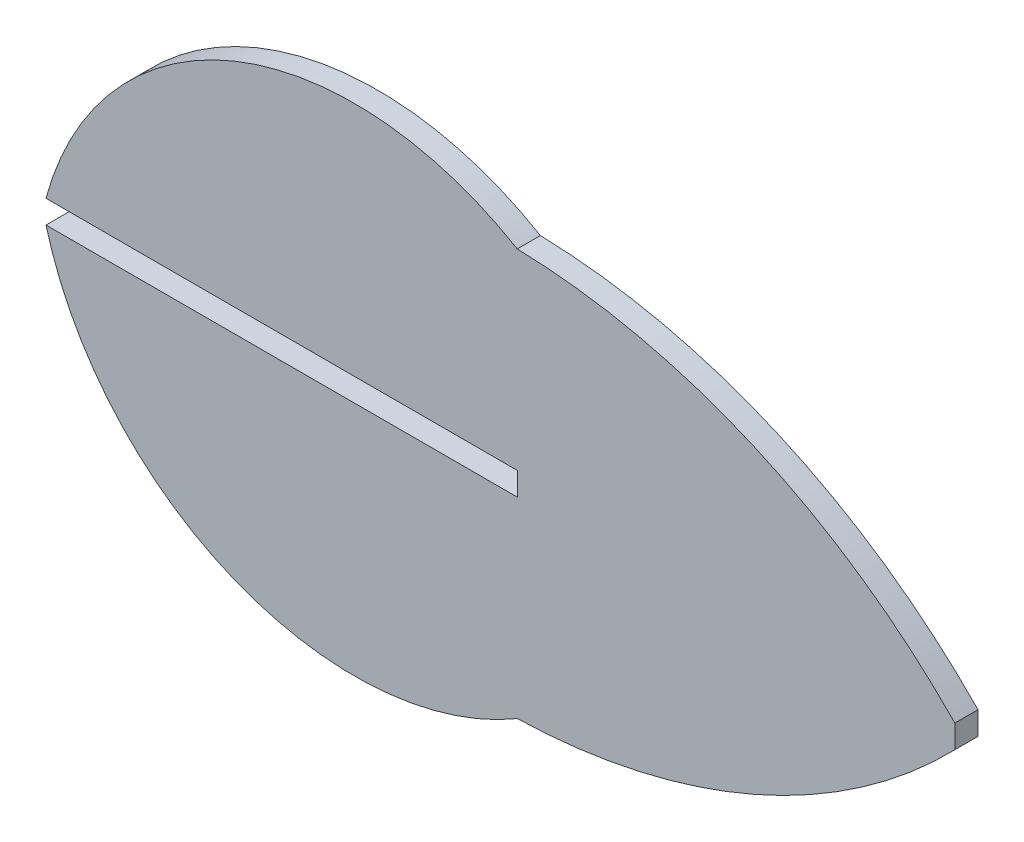
ISO-10303-21;
HEADER;
FILE_DESCRIPTION(('STEP AP214'),'2;1');
FILE_NAME('part.step','',(''),(''),'','','');
FILE_SCHEMA(('AUTOMOTIVE_DESIGN { 1 0 10303 214 1 1 1 1 }'));
ENDSEC;
DATA;
#1=APPLICATION_CONTEXT('core data for automotive mechanical design processes');
#2=APPLICATION_PROTOCOL_DEFINITION('international standard','automotive_design',2000,#1);
#3=PRODUCT_CONTEXT('',#1,'mechanical');
#4=PRODUCT('Part','Part','',(#3));
#5=PRODUCT_RELATED_PRODUCT_CATEGORY('part','',(#4));
#6=PRODUCT_DEFINITION_FORMATION('','',#4);
#7=PRODUCT_DEFINITION_CONTEXT('part definition',#1,'design');
#8=PRODUCT_DEFINITION('design','',#6,#7);
#9=PRODUCT_DEFINITION_SHAPE('','',#8);
#10=(LENGTH_UNIT() NAMED_UNIT(*) SI_UNIT(.MILLI.,.METRE.));
#11=(NAMED_UNIT(*) PLANE_ANGLE_UNIT() SI_UNIT($,.RADIAN.));
#12=(NAMED_UNIT(*) SI_UNIT($,.STERADIAN.) SOLID_ANGLE_UNIT());
#13=UNCERTAINTY_MEASURE_WITH_UNIT(LENGTH_MEASURE(1.E-05),#10,'distance_accuracy_value','');
#14=(GEOMETRIC_REPRESENTATION_CONTEXT(3) GLOBAL_UNCERTAINTY_ASSIGNED_CONTEXT((#13)) GLOBAL_UNIT_ASSIGNED_CONTEXT((#10,
#11,#12)) REPRESENTATION_CONTEXT('',''));
#15=CARTESIAN_POINT('',(0.,0.,0.));
#16=DIRECTION('',(0.,0.,1.));
#17=DIRECTION('',(1.,0.,0.));
#18=AXIS2_PLACEMENT_3D('',#15,#16,#17);
#19=CARTESIAN_POINT('',(81.3364746051978,27.569090768814,1.524));
#20=DIRECTION('',(0.,0.,-1.));
#21=DIRECTION('',(-1.,0.,0.));
#22=AXIS2_PLACEMENT_3D('',#19,#20,#21);
#23=CYLINDRICAL_SURFACE('',#22,41.7419919175404);
#24=CARTESIAN_POINT('',(81.3364746051978,27.569090768814,0.));
#25=DIRECTION('',(0.,0.,1.));
#26=DIRECTION('',(1.,0.,0.));
#27=AXIS2_PLACEMENT_3D('',#24,#25,#26);
#28=CIRCLE('',#27,41.7419919175404);
#29=CARTESIAN_POINT('',(82.4447013495764,-14.1581871525536,0.));
#30=VERTEX_POINT('',#29);
#31=CARTESIAN_POINT('',(111.269499156044,-1.524,0.));
#32=VERTEX_POINT('',#31);
#33=EDGE_CURVE('E129',#30,#32,#28,.T.);
#34=ORIENTED_EDGE('',*,*,#33,.T.);
#35=DIRECTION('',(0.,0.,-1.));
#36=VECTOR('',#35,1.);
#37=CARTESIAN_POINT('',(111.269499156044,-1.524,1.524));
#38=LINE('',#37,#36);
#39=CARTESIAN_POINT('',(111.269499156044,-1.524,1.524));
#40=VERTEX_POINT('',#39);
#41=EDGE_CURVE('E11',#40,#32,#38,.T.);
#42=ORIENTED_EDGE('',*,*,#41,.F.);
#43=CARTESIAN_POINT('',(81.3364746051978,27.569090768814,1.524));
#44=DIRECTION('',(0.,0.,1.));
#45=DIRECTION('',(1.,0.,0.));
#46=AXIS2_PLACEMENT_3D('',#43,#44,#45);
#47=CIRCLE('',#46,41.7419919175404);
#48=CARTESIAN_POINT('',(82.4447013495764,-14.1581871525536,1.524));
#49=VERTEX_POINT('',#48);
#50=EDGE_CURVE('E147',#49,#40,#47,.T.);
#51=ORIENTED_EDGE('',*,*,#50,.F.);
#52=DIRECTION('',(0.,0.,-1.));
#53=VECTOR('',#52,1.);
#54=CARTESIAN_POINT('',(82.4447013495764,-14.1581871525536,1.524));
#55=LINE('',#54,#53);
#56=EDGE_CURVE('E128',#49,#30,#55,.T.);
#57=ORIENTED_EDGE('',*,*,#56,.T.);
#58=EDGE_LOOP('',(#34,#42,#51,#57));
#59=FACE_BOUND('',#58,.T.);
#60=ADVANCED_FACE('F31',(#59),#23,.T.);
#61=CARTESIAN_POINT('',(111.269499156044,-1.524,1.524));
#62=DIRECTION('',(-1.,0.,0.));
#63=DIRECTION('',(0.,0.,1.));
#64=AXIS2_PLACEMENT_3D('',#61,#62,#63);
#65=PLANE('',#64);
#66=DIRECTION('',(0.,1.,0.));
#67=VECTOR('',#66,1.);
#68=CARTESIAN_POINT('',(111.269499156044,-1.524,0.));
#69=LINE('',#68,#67);
#70=CARTESIAN_POINT('',(111.269499156044,0.,0.));
#71=VERTEX_POINT('',#70);
#72=EDGE_CURVE('E132',#32,#71,#69,.T.);
#73=ORIENTED_EDGE('',*,*,#72,.T.);
#74=DIRECTION('',(0.,0.,-1.));
#75=VECTOR('',#74,1.);
#76=CARTESIAN_POINT('',(111.269499156044,0.,1.524));
#77=LINE('',#76,#75);
#78=CARTESIAN_POINT('',(111.269499156044,0.,1.524));
#79=VERTEX_POINT('',#78);
#80=EDGE_CURVE('E39',#79,#71,#77,.T.);
#81=ORIENTED_EDGE('',*,*,#80,.F.);
#82=DIRECTION('',(0.,1.,0.));
#83=VECTOR('',#82,1.);
#84=CARTESIAN_POINT('',(111.269499156044,-1.524,1.524));
#85=LINE('',#84,#83);
#86=EDGE_CURVE('E89',#40,#79,#85,.T.);
#87=ORIENTED_EDGE('',*,*,#86,.F.);
#88=ORIENTED_EDGE('',*,*,#41,.T.);
#89=EDGE_LOOP('',(#73,#81,#87,#88));
#90=FACE_BOUND('',#89,.T.);
#91=ADVANCED_FACE('F160',(#90),#65,.F.);
#92=CARTESIAN_POINT('',(81.3364746051978,-29.093090768814,1.524));
#93=DIRECTION('',(0.,0.,-1.));
#94=DIRECTION('',(-1.,0.,0.));
#95=AXIS2_PLACEMENT_3D('',#92,#93,#94);
#96=CYLINDRICAL_SURFACE('',#95,41.7419919175404);
#97=CARTESIAN_POINT('',(81.3364746051978,-29.093090768814,0.));
#98=DIRECTION('',(0.,0.,-1.));
#99=DIRECTION('',(-1.,0.,0.));
#100=AXIS2_PLACEMENT_3D('',#97,#98,#99);
#101=CIRCLE('',#100,41.7419919175404);
#102=CARTESIAN_POINT('',(82.4447013495764,12.6341871525536,0.));
#103=VERTEX_POINT('',#102);
#104=EDGE_CURVE('E135',#103,#71,#101,.T.);
#105=ORIENTED_EDGE('',*,*,#104,.F.);
#106=DIRECTION('',(0.,0.,-1.));
#107=VECTOR('',#106,1.);
#108=CARTESIAN_POINT('',(82.4447013495764,12.6341871525536,1.524));
#109=LINE('',#108,#107);
#110=CARTESIAN_POINT('',(82.4447013495764,12.6341871525536,1.524));
#111=VERTEX_POINT('',#110);
#112=EDGE_CURVE('E153',#111,#103,#109,.T.);
#113=ORIENTED_EDGE('',*,*,#112,.F.);
#114=CARTESIAN_POINT('',(81.3364746051978,-29.093090768814,1.524));
#115=DIRECTION('',(0.,0.,-1.));
#116=DIRECTION('',(-1.,0.,0.));
#117=AXIS2_PLACEMENT_3D('',#114,#115,#116);
#118=CIRCLE('',#117,41.7419919175404);
#119=EDGE_CURVE('E159',#111,#79,#118,.T.);
#120=ORIENTED_EDGE('',*,*,#119,.T.);
#121=ORIENTED_EDGE('',*,*,#80,.T.);
#122=EDGE_LOOP('',(#105,#113,#120,#121));
#123=FACE_BOUND('',#122,.T.);
#124=ADVANCED_FACE('F157',(#123),#96,.T.);
#125=CARTESIAN_POINT('',(71.7207425912122,-5.46795760990448,1.524));
#126=DIRECTION('',(0.,0.,-1.));
#127=DIRECTION('',(-1.,0.,0.));
#128=AXIS2_PLACEMENT_3D('',#125,#126,#127);
#129=CYLINDRICAL_SURFACE('',#128,21.0402218726914);
#130=CARTESIAN_POINT('',(71.7207425912122,-5.46795760990448,0.));
#131=DIRECTION('',(0.,0.,-1.));
#132=DIRECTION('',(-1.,0.,0.));
#133=AXIS2_PLACEMENT_3D('',#130,#131,#132);
#134=CIRCLE('',#133,21.0402218726914);
#135=CARTESIAN_POINT('',(51.4034500543517,0.,0.));
#136=VERTEX_POINT('',#135);
#137=EDGE_CURVE('E138',#136,#103,#134,.T.);
#138=ORIENTED_EDGE('',*,*,#137,.F.);
#139=DIRECTION('',(0.,0.,-1.));
#140=VECTOR('',#139,1.);
#141=CARTESIAN_POINT('',(51.4034500543517,0.,1.524));
#142=LINE('',#141,#140);
#143=CARTESIAN_POINT('',(51.4034500543517,0.,1.524));
#144=VERTEX_POINT('',#143);
#145=EDGE_CURVE('E151',#144,#136,#142,.T.);
#146=ORIENTED_EDGE('',*,*,#145,.F.);
#147=CARTESIAN_POINT('',(71.7207425912122,-5.46795760990448,1.524));
#148=DIRECTION('',(0.,0.,-1.));
#149=DIRECTION('',(-1.,0.,0.));
#150=AXIS2_PLACEMENT_3D('',#147,#148,#149);
#151=CIRCLE('',#150,21.0402218726914);
#152=EDGE_CURVE('E123',#144,#111,#151,.T.);
#153=ORIENTED_EDGE('',*,*,#152,.T.);
#154=ORIENTED_EDGE('',*,*,#112,.T.);
#155=EDGE_LOOP('',(#138,#146,#153,#154));
#156=FACE_BOUND('',#155,.T.);
#157=ADVANCED_FACE('F168',(#156),#129,.T.);
#158=CARTESIAN_POINT('',(82.4447013495764,0.,1.524));
#159=DIRECTION('',(0.,-1.,0.));
#160=DIRECTION('',(0.,0.,-1.));
#161=AXIS2_PLACEMENT_3D('',#158,#159,#160);
#162=PLANE('',#161);
#163=DIRECTION('',(-1.,0.,0.));
#164=VECTOR('',#163,1.);
#165=CARTESIAN_POINT('',(82.4447013495764,0.,0.));
#166=LINE('',#165,#164);
#167=CARTESIAN_POINT('',(82.4447013495764,0.,0.));
#168=VERTEX_POINT('',#167);
#169=EDGE_CURVE('E141',#168,#136,#166,.T.);
#170=ORIENTED_EDGE('',*,*,#169,.F.);
#171=DIRECTION('',(0.,0.,-1.));
#172=VECTOR('',#171,1.);
#173=CARTESIAN_POINT('',(82.4447013495764,0.,1.524));
#174=LINE('',#173,#172);
#175=CARTESIAN_POINT('',(82.4447013495764,0.,1.524));
#176=VERTEX_POINT('',#175);
#177=EDGE_CURVE('E111',#176,#168,#174,.T.);
#178=ORIENTED_EDGE('',*,*,#177,.F.);
#179=DIRECTION('',(-1.,0.,0.));
#180=VECTOR('',#179,1.);
#181=CARTESIAN_POINT('',(82.4447013495764,0.,1.524));
#182=LINE('',#181,#180);
#183=EDGE_CURVE('E121',#176,#144,#182,.T.);
#184=ORIENTED_EDGE('',*,*,#183,.T.);
#185=ORIENTED_EDGE('',*,*,#145,.T.);
#186=EDGE_LOOP('',(#170,#178,#184,#185));
#187=FACE_BOUND('',#186,.T.);
#188=ADVANCED_FACE('F196',(#187),#162,.T.);
#189=CARTESIAN_POINT('',(82.4447013495764,-1.524,1.524));
#190=DIRECTION('',(-1.,0.,0.));
#191=DIRECTION('',(0.,0.,1.));
#192=AXIS2_PLACEMENT_3D('',#189,#190,#191);
#193=PLANE('',#192);
#194=DIRECTION('',(0.,1.,0.));
#195=VECTOR('',#194,1.);
#196=CARTESIAN_POINT('',(82.4447013495764,-1.524,0.));
#197=LINE('',#196,#195);
#198=CARTESIAN_POINT('',(82.4447013495764,-1.524,0.));
#199=VERTEX_POINT('',#198);
#200=EDGE_CURVE('E110',#199,#168,#197,.T.);
#201=ORIENTED_EDGE('',*,*,#200,.F.);
#202=DIRECTION('',(0.,0.,-1.));
#203=VECTOR('',#202,1.);
#204=CARTESIAN_POINT('',(82.4447013495764,-1.524,1.524));
#205=LINE('',#204,#203);
#206=CARTESIAN_POINT('',(82.4447013495764,-1.524,1.524));
#207=VERTEX_POINT('',#206);
#208=EDGE_CURVE('E104',#207,#199,#205,.T.);
#209=ORIENTED_EDGE('',*,*,#208,.F.);
#210=DIRECTION('',(0.,1.,0.));
#211=VECTOR('',#210,1.);
#212=CARTESIAN_POINT('',(82.4447013495764,-1.524,1.524));
#213=LINE('',#212,#211);
#214=EDGE_CURVE('E108',#207,#176,#213,.T.);
#215=ORIENTED_EDGE('',*,*,#214,.T.);
#216=ORIENTED_EDGE('',*,*,#177,.T.);
#217=EDGE_LOOP('',(#201,#209,#215,#216));
#218=FACE_BOUND('',#217,.T.);
#219=ADVANCED_FACE('F106',(#218),#193,.T.);
#220=CARTESIAN_POINT('',(82.4447013495764,-1.524,1.524));
#221=DIRECTION('',(0.,-1.,0.));
#222=DIRECTION('',(1.,0.,0.));
#223=AXIS2_PLACEMENT_3D('',#220,#221,#222);
#224=PLANE('',#223);
#225=DIRECTION('',(-1.,0.,0.));
#226=VECTOR('',#225,1.);
#227=CARTESIAN_POINT('',(82.4447013495764,-1.524,0.));
#228=LINE('',#227,#226);
#229=CARTESIAN_POINT('',(51.4034500543517,-1.524,0.));
#230=VERTEX_POINT('',#229);
#231=EDGE_CURVE('E75',#199,#230,#228,.T.);
#232=ORIENTED_EDGE('',*,*,#231,.T.);
#233=DIRECTION('',(0.,0.,-1.));
#234=VECTOR('',#233,1.);
#235=CARTESIAN_POINT('',(51.4034500543517,-1.524,1.524));
#236=LINE('',#235,#234);
#237=CARTESIAN_POINT('',(51.4034500543517,-1.524,1.524));
#238=VERTEX_POINT('',#237);
#239=EDGE_CURVE('E112',#238,#230,#236,.T.);
#240=ORIENTED_EDGE('',*,*,#239,.F.);
#241=DIRECTION('',(-1.,0.,0.));
#242=VECTOR('',#241,1.);
#243=CARTESIAN_POINT('',(82.4447013495764,-1.524,1.524));
#244=LINE('',#243,#242);
#245=EDGE_CURVE('E114',#207,#238,#244,.T.);
#246=ORIENTED_EDGE('',*,*,#245,.F.);
#247=ORIENTED_EDGE('',*,*,#208,.T.);
#248=EDGE_LOOP('',(#232,#240,#246,#247));
#249=FACE_BOUND('',#248,.T.);
#250=ADVANCED_FACE('F115',(#249),#224,.F.);
#251=CARTESIAN_POINT('',(71.7207425912122,3.94395760990448,1.524));
#252=DIRECTION('',(0.,0.,-1.));
#253=DIRECTION('',(-1.,0.,0.));
#254=AXIS2_PLACEMENT_3D('',#251,#252,#253);
#255=CYLINDRICAL_SURFACE('',#254,21.0402218726914);
#256=CARTESIAN_POINT('',(71.7207425912122,3.94395760990448,0.));
#257=DIRECTION('',(0.,0.,1.));
#258=DIRECTION('',(1.,0.,0.));
#259=AXIS2_PLACEMENT_3D('',#256,#257,#258);
#260=CIRCLE('',#259,21.0402218726914);
#261=EDGE_CURVE('E81',#230,#30,#260,.T.);
#262=ORIENTED_EDGE('',*,*,#261,.T.);
#263=ORIENTED_EDGE('',*,*,#56,.F.);
#264=CARTESIAN_POINT('',(71.7207425912122,3.94395760990448,1.524));
#265=DIRECTION('',(0.,0.,1.));
#266=DIRECTION('',(1.,0.,0.));
#267=AXIS2_PLACEMENT_3D('',#264,#265,#266);
#268=CIRCLE('',#267,21.0402218726914);
#269=EDGE_CURVE('E47',#238,#49,#268,.T.);
#270=ORIENTED_EDGE('',*,*,#269,.F.);
#271=ORIENTED_EDGE('',*,*,#239,.T.);
#272=EDGE_LOOP('',(#262,#263,#270,#271));
#273=FACE_BOUND('',#272,.T.);
#274=ADVANCED_FACE('F175',(#273),#255,.T.);
#275=CARTESIAN_POINT('',(81.3364746051978,27.569090768814,1.524));
#276=DIRECTION('',(0.,0.,1.));
#277=DIRECTION('',(1.,0.,0.));
#278=AXIS2_PLACEMENT_3D('',#275,#276,#277);
#279=PLANE('',#278);
#280=ORIENTED_EDGE('',*,*,#50,.T.);
#281=ORIENTED_EDGE('',*,*,#86,.T.);
#282=ORIENTED_EDGE('',*,*,#119,.F.);
#283=ORIENTED_EDGE('',*,*,#152,.F.);
#284=ORIENTED_EDGE('',*,*,#183,.F.);
#285=ORIENTED_EDGE('',*,*,#214,.F.);
#286=ORIENTED_EDGE('',*,*,#245,.T.);
#287=ORIENTED_EDGE('',*,*,#269,.T.);
#288=EDGE_LOOP('',(#280,#281,#282,#283,#284,#285,#286,#287));
#289=FACE_BOUND('',#288,.T.);
#290=ADVANCED_FACE('F118',(#289),#279,.T.);
#291=CARTESIAN_POINT('',(81.3364746051978,27.569090768814,0.));
#292=DIRECTION('',(0.,0.,1.));
#293=DIRECTION('',(1.,0.,0.));
#294=AXIS2_PLACEMENT_3D('',#291,#292,#293);
#295=PLANE('',#294);
#296=ORIENTED_EDGE('',*,*,#33,.F.);
#297=ORIENTED_EDGE('',*,*,#261,.F.);
#298=ORIENTED_EDGE('',*,*,#231,.F.);
#299=ORIENTED_EDGE('',*,*,#200,.T.);
#300=ORIENTED_EDGE('',*,*,#169,.T.);
#301=ORIENTED_EDGE('',*,*,#137,.T.);
#302=ORIENTED_EDGE('',*,*,#104,.T.);
#303=ORIENTED_EDGE('',*,*,#72,.F.);
#304=EDGE_LOOP('',(#296,#297,#298,#299,#300,#301,#302,#303));
#305=FACE_BOUND('',#304,.T.);
#306=ADVANCED_FACE('F164',(#305),#295,.F.);
#307=CLOSED_SHELL('',(#60,#91,#124,#157,#188,#219,#250,#274,#290,#306));
#308=MANIFOLD_SOLID_BREP('B2',#307);
#309=ADVANCED_BREP_SHAPE_REPRESENTATION('',(#18,#308),#14);
#310=SHAPE_DEFINITION_REPRESENTATION(#9,#309);
ENDSEC;
END-ISO-10303-21;
